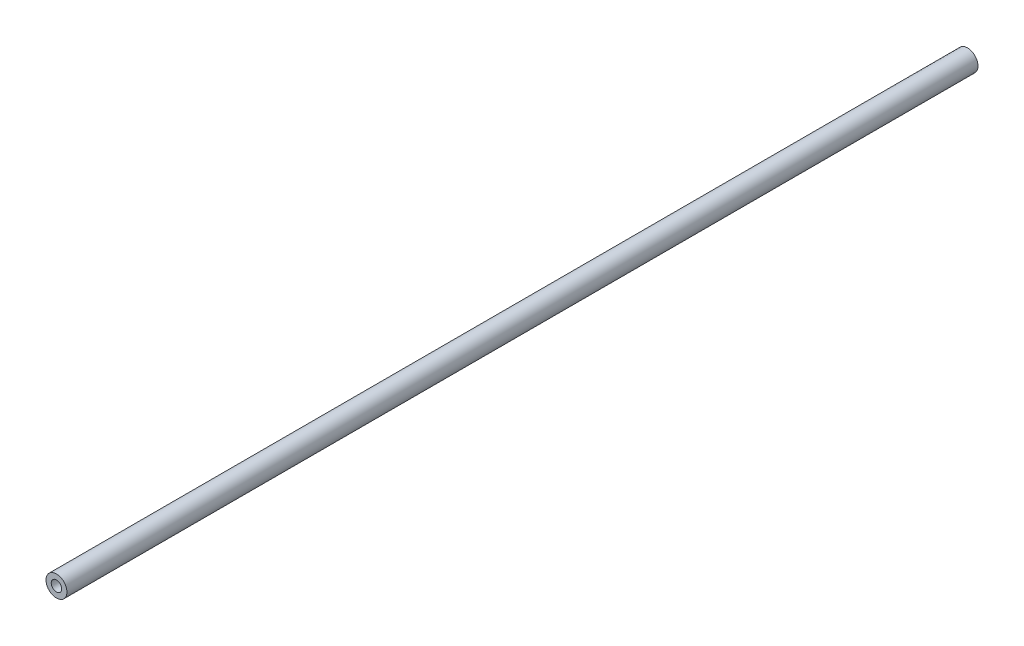
ISO-10303-21;
HEADER;
FILE_DESCRIPTION(('STEP AP214'),'2;1');
FILE_NAME('part.step','',(''),(''),'','','');
FILE_SCHEMA(('AUTOMOTIVE_DESIGN { 1 0 10303 214 1 1 1 1 }'));
ENDSEC;
DATA;
#1=APPLICATION_CONTEXT('core data for automotive mechanical design processes');
#2=APPLICATION_PROTOCOL_DEFINITION('international standard','automotive_design',2000,#1);
#3=PRODUCT_CONTEXT('',#1,'mechanical');
#4=PRODUCT('Part','Part','',(#3));
#5=PRODUCT_RELATED_PRODUCT_CATEGORY('part','',(#4));
#6=PRODUCT_DEFINITION_FORMATION('','',#4);
#7=PRODUCT_DEFINITION_CONTEXT('part definition',#1,'design');
#8=PRODUCT_DEFINITION('design','',#6,#7);
#9=PRODUCT_DEFINITION_SHAPE('','',#8);
#10=(LENGTH_UNIT() NAMED_UNIT(*) SI_UNIT(.MILLI.,.METRE.));
#11=(NAMED_UNIT(*) PLANE_ANGLE_UNIT() SI_UNIT($,.RADIAN.));
#12=(NAMED_UNIT(*) SI_UNIT($,.STERADIAN.) SOLID_ANGLE_UNIT());
#13=UNCERTAINTY_MEASURE_WITH_UNIT(LENGTH_MEASURE(1.E-05),#10,'distance_accuracy_value','');
#14=(GEOMETRIC_REPRESENTATION_CONTEXT(3) GLOBAL_UNCERTAINTY_ASSIGNED_CONTEXT((#13)) GLOBAL_UNIT_ASSIGNED_CONTEXT((#10,
#11,#12)) REPRESENTATION_CONTEXT('',''));
#15=CARTESIAN_POINT('',(0.,0.,0.));
#16=DIRECTION('',(0.,0.,1.));
#17=DIRECTION('',(1.,0.,0.));
#18=AXIS2_PLACEMENT_3D('',#15,#16,#17);
#19=CARTESIAN_POINT('',(0.,0.,1104.9));
#20=DIRECTION('',(0.,0.,1.));
#21=DIRECTION('',(1.,0.,0.));
#22=AXIS2_PLACEMENT_3D('',#19,#20,#21);
#23=PLANE('',#22);
#24=CARTESIAN_POINT('',(0.,0.,1104.9));
#25=DIRECTION('',(0.,0.,1.));
#26=DIRECTION('',(1.,0.,0.));
#27=AXIS2_PLACEMENT_3D('',#24,#25,#26);
#28=CIRCLE('',#27,12.7);
#29=CARTESIAN_POINT('',(12.7,0.,1104.9));
#30=VERTEX_POINT('',#29);
#31=EDGE_CURVE('E10',#30,#30,#28,.T.);
#32=ORIENTED_EDGE('',*,*,#31,.T.);
#33=EDGE_LOOP('',(#32));
#34=FACE_BOUND('',#33,.T.);
#35=CARTESIAN_POINT('',(0.,0.,1104.9));
#36=DIRECTION('',(0.,0.,1.));
#37=DIRECTION('',(1.,0.,0.));
#38=AXIS2_PLACEMENT_3D('',#35,#36,#37);
#39=CIRCLE('',#38,6.35);
#40=CARTESIAN_POINT('',(6.35,0.,1104.9));
#41=VERTEX_POINT('',#40);
#42=EDGE_CURVE('E44',#41,#41,#39,.T.);
#43=ORIENTED_EDGE('',*,*,#42,.F.);
#44=EDGE_LOOP('',(#43));
#45=FACE_BOUND('',#44,.T.);
#46=ADVANCED_FACE('F33',(#34,#45),#23,.T.);
#47=CARTESIAN_POINT('',(0.,0.,0.));
#48=DIRECTION('',(0.,0.,1.));
#49=DIRECTION('',(1.,0.,0.));
#50=AXIS2_PLACEMENT_3D('',#47,#48,#49);
#51=PLANE('',#50);
#52=CARTESIAN_POINT('',(0.,0.,0.));
#53=DIRECTION('',(0.,0.,1.));
#54=DIRECTION('',(1.,0.,0.));
#55=AXIS2_PLACEMENT_3D('',#52,#53,#54);
#56=CIRCLE('',#55,12.7);
#57=CARTESIAN_POINT('',(12.7,0.,0.));
#58=VERTEX_POINT('',#57);
#59=EDGE_CURVE('E37',#58,#58,#56,.T.);
#60=ORIENTED_EDGE('',*,*,#59,.F.);
#61=EDGE_LOOP('',(#60));
#62=FACE_BOUND('',#61,.T.);
#63=CARTESIAN_POINT('',(0.,0.,0.));
#64=DIRECTION('',(0.,0.,1.));
#65=DIRECTION('',(1.,0.,0.));
#66=AXIS2_PLACEMENT_3D('',#63,#64,#65);
#67=CIRCLE('',#66,6.35);
#68=CARTESIAN_POINT('',(6.35,0.,0.));
#69=VERTEX_POINT('',#68);
#70=EDGE_CURVE('E46',#69,#69,#67,.T.);
#71=ORIENTED_EDGE('',*,*,#70,.T.);
#72=EDGE_LOOP('',(#71));
#73=FACE_BOUND('',#72,.T.);
#74=ADVANCED_FACE('F56',(#62,#73),#51,.F.);
#75=CARTESIAN_POINT('',(0.,0.,1104.9));
#76=DIRECTION('',(0.,0.,-1.));
#77=DIRECTION('',(-1.,0.,0.));
#78=AXIS2_PLACEMENT_3D('',#75,#76,#77);
#79=CYLINDRICAL_SURFACE('',#78,12.7);
#80=ORIENTED_EDGE('',*,*,#31,.F.);
#81=EDGE_LOOP('',(#80));
#82=FACE_BOUND('',#81,.T.);
#83=ORIENTED_EDGE('',*,*,#59,.T.);
#84=EDGE_LOOP('',(#83));
#85=FACE_BOUND('',#84,.T.);
#86=ADVANCED_FACE('F35',(#82,#85),#79,.T.);
#87=CARTESIAN_POINT('',(0.,0.,1104.9));
#88=DIRECTION('',(0.,0.,-1.));
#89=DIRECTION('',(-1.,0.,0.));
#90=AXIS2_PLACEMENT_3D('',#87,#88,#89);
#91=CYLINDRICAL_SURFACE('',#90,6.35);
#92=ORIENTED_EDGE('',*,*,#42,.T.);
#93=EDGE_LOOP('',(#92));
#94=FACE_BOUND('',#93,.T.);
#95=ORIENTED_EDGE('',*,*,#70,.F.);
#96=EDGE_LOOP('',(#95));
#97=FACE_BOUND('',#96,.T.);
#98=ADVANCED_FACE('F52',(#94,#97),#91,.F.);
#99=CLOSED_SHELL('',(#46,#74,#86,#98));
#100=MANIFOLD_SOLID_BREP('B2',#99);
#101=ADVANCED_BREP_SHAPE_REPRESENTATION('',(#18,#100),#14);
#102=SHAPE_DEFINITION_REPRESENTATION(#9,#101);
ENDSEC;
END-ISO-10303-21;
